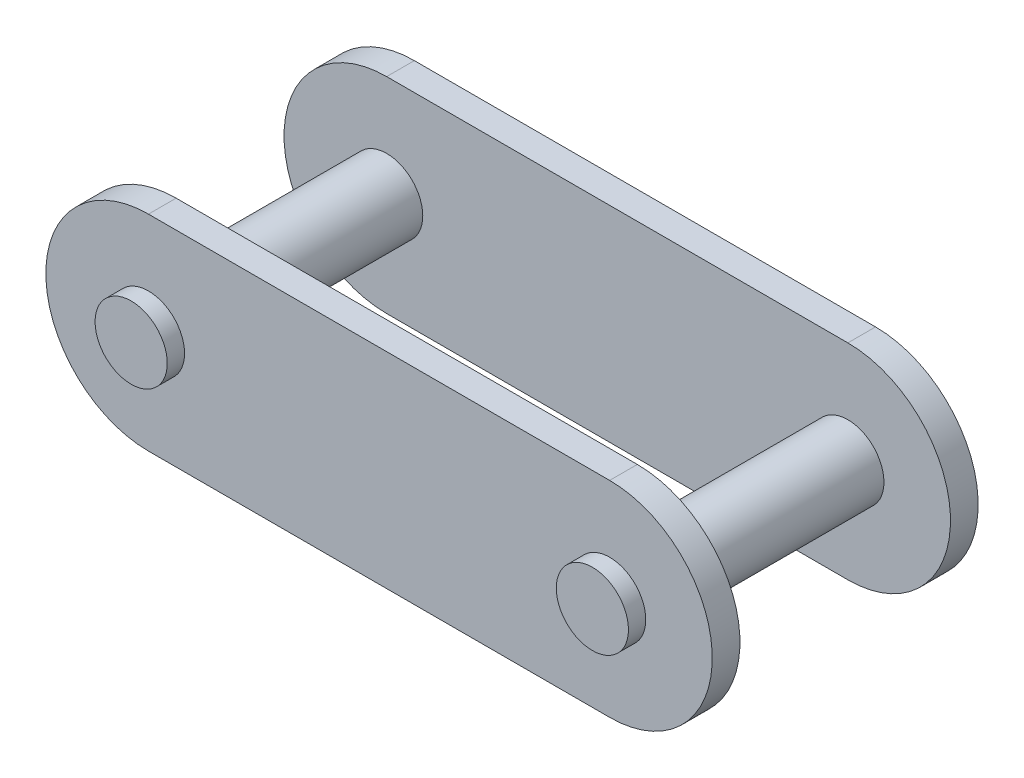
ISO-10303-21;
HEADER;
FILE_DESCRIPTION(('STEP AP214'),'2;1');
FILE_NAME('part.step','',(''),(''),'','','');
FILE_SCHEMA(('AUTOMOTIVE_DESIGN { 1 0 10303 214 1 1 1 1 }'));
ENDSEC;
DATA;
#1=APPLICATION_CONTEXT('core data for automotive mechanical design processes');
#2=APPLICATION_PROTOCOL_DEFINITION('international standard','automotive_design',2000,#1);
#3=PRODUCT_CONTEXT('',#1,'mechanical');
#4=PRODUCT('Part','Part','',(#3));
#5=PRODUCT_RELATED_PRODUCT_CATEGORY('part','',(#4));
#6=PRODUCT_DEFINITION_FORMATION('','',#4);
#7=PRODUCT_DEFINITION_CONTEXT('part definition',#1,'design');
#8=PRODUCT_DEFINITION('design','',#6,#7);
#9=PRODUCT_DEFINITION_SHAPE('','',#8);
#10=(LENGTH_UNIT() NAMED_UNIT(*) SI_UNIT(.MILLI.,.METRE.));
#11=(NAMED_UNIT(*) PLANE_ANGLE_UNIT() SI_UNIT($,.RADIAN.));
#12=(NAMED_UNIT(*) SI_UNIT($,.STERADIAN.) SOLID_ANGLE_UNIT());
#13=UNCERTAINTY_MEASURE_WITH_UNIT(LENGTH_MEASURE(1.E-05),#10,'distance_accuracy_value','');
#14=(GEOMETRIC_REPRESENTATION_CONTEXT(3) GLOBAL_UNCERTAINTY_ASSIGNED_CONTEXT((#13)) GLOBAL_UNIT_ASSIGNED_CONTEXT((#10,
#11,#12)) REPRESENTATION_CONTEXT('',''));
#15=CARTESIAN_POINT('',(0.,0.,0.));
#16=DIRECTION('',(0.,0.,1.));
#17=DIRECTION('',(1.,0.,0.));
#18=AXIS2_PLACEMENT_3D('',#15,#16,#17);
#19=CARTESIAN_POINT('',(-12.7,0.,1.524));
#20=DIRECTION('',(0.,0.,1.));
#21=DIRECTION('',(1.,0.,0.));
#22=AXIS2_PLACEMENT_3D('',#19,#20,#21);
#23=PLANE('',#22);
#24=CARTESIAN_POINT('',(-12.7,0.,1.524));
#25=DIRECTION('',(0.,0.,1.));
#26=DIRECTION('',(1.,0.,0.));
#27=AXIS2_PLACEMENT_3D('',#24,#25,#26);
#28=CIRCLE('',#27,1.98755);
#29=CARTESIAN_POINT('',(-10.71245,0.,1.524));
#30=VERTEX_POINT('',#29);
#31=EDGE_CURVE('E167',#30,#30,#28,.T.);
#32=ORIENTED_EDGE('',*,*,#31,.F.);
#33=EDGE_LOOP('',(#32));
#34=FACE_BOUND('',#33,.T.);
#35=CARTESIAN_POINT('',(-12.7,0.,1.524));
#36=DIRECTION('',(0.,0.,1.));
#37=DIRECTION('',(1.,0.,0.));
#38=AXIS2_PLACEMENT_3D('',#35,#36,#37);
#39=CIRCLE('',#38,5.6515);
#40=CARTESIAN_POINT('',(-12.7,5.6515,1.524));
#41=VERTEX_POINT('',#40);
#42=CARTESIAN_POINT('',(-12.7,-5.6515,1.524));
#43=VERTEX_POINT('',#42);
#44=EDGE_CURVE('E171',#41,#43,#39,.T.);
#45=ORIENTED_EDGE('',*,*,#44,.T.);
#46=DIRECTION('',(1.,0.,0.));
#47=VECTOR('',#46,1.);
#48=CARTESIAN_POINT('',(-12.7,-5.6515,1.524));
#49=LINE('',#48,#47);
#50=CARTESIAN_POINT('',(12.7,-5.6515,1.524));
#51=VERTEX_POINT('',#50);
#52=EDGE_CURVE('E79',#43,#51,#49,.T.);
#53=ORIENTED_EDGE('',*,*,#52,.T.);
#54=CARTESIAN_POINT('',(12.7,0.,1.524));
#55=DIRECTION('',(0.,0.,1.));
#56=DIRECTION('',(1.,0.,0.));
#57=AXIS2_PLACEMENT_3D('',#54,#55,#56);
#58=CIRCLE('',#57,5.6515);
#59=CARTESIAN_POINT('',(12.7,5.6515,1.524));
#60=VERTEX_POINT('',#59);
#61=EDGE_CURVE('E174',#51,#60,#58,.T.);
#62=ORIENTED_EDGE('',*,*,#61,.T.);
#63=DIRECTION('',(-1.,0.,0.));
#64=VECTOR('',#63,1.);
#65=CARTESIAN_POINT('',(-12.7,5.6515,1.524));
#66=LINE('',#65,#64);
#67=EDGE_CURVE('E48',#60,#41,#66,.T.);
#68=ORIENTED_EDGE('',*,*,#67,.T.);
#69=EDGE_LOOP('',(#45,#53,#62,#68));
#70=FACE_BOUND('',#69,.T.);
#71=CARTESIAN_POINT('',(12.7,0.,1.524));
#72=DIRECTION('',(0.,0.,1.));
#73=DIRECTION('',(1.,0.,0.));
#74=AXIS2_PLACEMENT_3D('',#71,#72,#73);
#75=CIRCLE('',#74,1.98755);
#76=CARTESIAN_POINT('',(14.68755,0.,1.524));
#77=VERTEX_POINT('',#76);
#78=EDGE_CURVE('E164',#77,#77,#75,.T.);
#79=ORIENTED_EDGE('',*,*,#78,.F.);
#80=EDGE_LOOP('',(#79));
#81=FACE_BOUND('',#80,.T.);
#82=ADVANCED_FACE('F31',(#34,#70,#81),#23,.T.);
#83=CARTESIAN_POINT('',(-12.7,0.,0.));
#84=DIRECTION('',(0.,0.,1.));
#85=DIRECTION('',(1.,0.,0.));
#86=AXIS2_PLACEMENT_3D('',#83,#84,#85);
#87=PLANE('',#86);
#88=CARTESIAN_POINT('',(-12.7,0.,0.));
#89=DIRECTION('',(0.,0.,1.));
#90=DIRECTION('',(1.,0.,0.));
#91=AXIS2_PLACEMENT_3D('',#88,#89,#90);
#92=CIRCLE('',#91,1.98755);
#93=CARTESIAN_POINT('',(-10.71245,0.,0.));
#94=VERTEX_POINT('',#93);
#95=EDGE_CURVE('E155',#94,#94,#92,.F.);
#96=ORIENTED_EDGE('',*,*,#95,.F.);
#97=EDGE_LOOP('',(#96));
#98=FACE_BOUND('',#97,.T.);
#99=CARTESIAN_POINT('',(-12.7,0.,0.));
#100=DIRECTION('',(0.,0.,1.));
#101=DIRECTION('',(1.,0.,0.));
#102=AXIS2_PLACEMENT_3D('',#99,#100,#101);
#103=CIRCLE('',#102,5.6515);
#104=CARTESIAN_POINT('',(-12.7,5.6515,0.));
#105=VERTEX_POINT('',#104);
#106=CARTESIAN_POINT('',(-12.7,-5.6515,0.));
#107=VERTEX_POINT('',#106);
#108=EDGE_CURVE('E170',#105,#107,#103,.T.);
#109=ORIENTED_EDGE('',*,*,#108,.F.);
#110=DIRECTION('',(-1.,0.,0.));
#111=VECTOR('',#110,1.);
#112=CARTESIAN_POINT('',(-12.7,5.6515,0.));
#113=LINE('',#112,#111);
#114=CARTESIAN_POINT('',(12.7,5.6515,0.));
#115=VERTEX_POINT('',#114);
#116=EDGE_CURVE('E72',#115,#105,#113,.T.);
#117=ORIENTED_EDGE('',*,*,#116,.F.);
#118=CARTESIAN_POINT('',(12.7,0.,0.));
#119=DIRECTION('',(0.,0.,1.));
#120=DIRECTION('',(1.,0.,0.));
#121=AXIS2_PLACEMENT_3D('',#118,#119,#120);
#122=CIRCLE('',#121,5.6515);
#123=CARTESIAN_POINT('',(12.7,-5.6515,0.));
#124=VERTEX_POINT('',#123);
#125=EDGE_CURVE('E66',#124,#115,#122,.T.);
#126=ORIENTED_EDGE('',*,*,#125,.F.);
#127=DIRECTION('',(1.,0.,0.));
#128=VECTOR('',#127,1.);
#129=CARTESIAN_POINT('',(-12.7,-5.6515,0.));
#130=LINE('',#129,#128);
#131=EDGE_CURVE('E180',#107,#124,#130,.T.);
#132=ORIENTED_EDGE('',*,*,#131,.F.);
#133=EDGE_LOOP('',(#109,#117,#126,#132));
#134=FACE_BOUND('',#133,.T.);
#135=CARTESIAN_POINT('',(12.7,0.,0.));
#136=DIRECTION('',(0.,0.,1.));
#137=DIRECTION('',(1.,0.,0.));
#138=AXIS2_PLACEMENT_3D('',#135,#136,#137);
#139=CIRCLE('',#138,1.98755);
#140=CARTESIAN_POINT('',(14.68755,0.,0.));
#141=VERTEX_POINT('',#140);
#142=EDGE_CURVE('E161',#141,#141,#139,.F.);
#143=ORIENTED_EDGE('',*,*,#142,.F.);
#144=EDGE_LOOP('',(#143));
#145=FACE_BOUND('',#144,.T.);
#146=ADVANCED_FACE('F190',(#98,#134,#145),#87,.F.);
#147=CARTESIAN_POINT('',(-12.7,0.,1.524));
#148=DIRECTION('',(0.,0.,-1.));
#149=DIRECTION('',(-1.,0.,0.));
#150=AXIS2_PLACEMENT_3D('',#147,#148,#149);
#151=CYLINDRICAL_SURFACE('',#150,5.6515);
#152=ORIENTED_EDGE('',*,*,#108,.T.);
#153=DIRECTION('',(0.,0.,-1.));
#154=VECTOR('',#153,1.);
#155=CARTESIAN_POINT('',(-12.7,-5.6515,1.524));
#156=LINE('',#155,#154);
#157=EDGE_CURVE('E11',#43,#107,#156,.T.);
#158=ORIENTED_EDGE('',*,*,#157,.F.);
#159=ORIENTED_EDGE('',*,*,#44,.F.);
#160=DIRECTION('',(0.,0.,-1.));
#161=VECTOR('',#160,1.);
#162=CARTESIAN_POINT('',(-12.7,5.6515,1.524));
#163=LINE('',#162,#161);
#164=EDGE_CURVE('E177',#41,#105,#163,.T.);
#165=ORIENTED_EDGE('',*,*,#164,.T.);
#166=EDGE_LOOP('',(#152,#158,#159,#165));
#167=FACE_BOUND('',#166,.T.);
#168=ADVANCED_FACE('F33',(#167),#151,.T.);
#169=CARTESIAN_POINT('',(-12.7,-5.6515,1.524));
#170=DIRECTION('',(0.,1.,0.));
#171=DIRECTION('',(-1.,0.,0.));
#172=AXIS2_PLACEMENT_3D('',#169,#170,#171);
#173=PLANE('',#172);
#174=ORIENTED_EDGE('',*,*,#131,.T.);
#175=DIRECTION('',(0.,0.,-1.));
#176=VECTOR('',#175,1.);
#177=CARTESIAN_POINT('',(12.7,-5.6515,1.524));
#178=LINE('',#177,#176);
#179=EDGE_CURVE('E40',#51,#124,#178,.T.);
#180=ORIENTED_EDGE('',*,*,#179,.F.);
#181=ORIENTED_EDGE('',*,*,#52,.F.);
#182=ORIENTED_EDGE('',*,*,#157,.T.);
#183=EDGE_LOOP('',(#174,#180,#181,#182));
#184=FACE_BOUND('',#183,.T.);
#185=ADVANCED_FACE('F207',(#184),#173,.F.);
#186=CARTESIAN_POINT('',(12.7,0.,1.524));
#187=DIRECTION('',(0.,0.,-1.));
#188=DIRECTION('',(-1.,0.,0.));
#189=AXIS2_PLACEMENT_3D('',#186,#187,#188);
#190=CYLINDRICAL_SURFACE('',#189,5.6515);
#191=ORIENTED_EDGE('',*,*,#125,.T.);
#192=DIRECTION('',(0.,0.,-1.));
#193=VECTOR('',#192,1.);
#194=CARTESIAN_POINT('',(12.7,5.6515,1.524));
#195=LINE('',#194,#193);
#196=EDGE_CURVE('E185',#60,#115,#195,.T.);
#197=ORIENTED_EDGE('',*,*,#196,.F.);
#198=ORIENTED_EDGE('',*,*,#61,.F.);
#199=ORIENTED_EDGE('',*,*,#179,.T.);
#200=EDGE_LOOP('',(#191,#197,#198,#199));
#201=FACE_BOUND('',#200,.T.);
#202=ADVANCED_FACE('F187',(#201),#190,.T.);
#203=CARTESIAN_POINT('',(-12.7,5.6515,1.524));
#204=DIRECTION('',(0.,-1.,0.));
#205=DIRECTION('',(1.,0.,0.));
#206=AXIS2_PLACEMENT_3D('',#203,#204,#205);
#207=PLANE('',#206);
#208=ORIENTED_EDGE('',*,*,#116,.T.);
#209=ORIENTED_EDGE('',*,*,#164,.F.);
#210=ORIENTED_EDGE('',*,*,#67,.F.);
#211=ORIENTED_EDGE('',*,*,#196,.T.);
#212=EDGE_LOOP('',(#208,#209,#210,#211));
#213=FACE_BOUND('',#212,.T.);
#214=ADVANCED_FACE('F195',(#213),#207,.F.);
#215=CARTESIAN_POINT('',(12.7,0.,-11.4191903317893));
#216=DIRECTION('',(0.,0.,1.));
#217=DIRECTION('',(1.,0.,0.));
#218=AXIS2_PLACEMENT_3D('',#215,#216,#217);
#219=CYLINDRICAL_SURFACE('',#218,1.98755);
#220=ORIENTED_EDGE('',*,*,#142,.T.);
#221=EDGE_LOOP('',(#220));
#222=FACE_BOUND('',#221,.T.);
#223=CARTESIAN_POINT('',(12.7,0.,-11.5951));
#224=DIRECTION('',(0.,0.,1.));
#225=DIRECTION('',(1.,0.,0.));
#226=AXIS2_PLACEMENT_3D('',#223,#224,#225);
#227=CIRCLE('',#226,1.98755);
#228=CARTESIAN_POINT('',(14.68755,0.,-11.5951));
#229=VERTEX_POINT('',#228);
#230=EDGE_CURVE('E281',#229,#229,#227,.F.);
#231=ORIENTED_EDGE('',*,*,#230,.F.);
#232=EDGE_LOOP('',(#231));
#233=FACE_BOUND('',#232,.T.);
#234=ADVANCED_FACE('F197',(#222,#233),#219,.T.);
#235=CARTESIAN_POINT('',(12.7,0.,2.4765));
#236=DIRECTION('',(0.,0.,-1.));
#237=DIRECTION('',(-1.,0.,0.));
#238=AXIS2_PLACEMENT_3D('',#235,#236,#237);
#239=PLANE('',#238);
#240=CARTESIAN_POINT('',(12.7,0.,2.4765));
#241=DIRECTION('',(0.,0.,-1.));
#242=DIRECTION('',(-1.,0.,0.));
#243=AXIS2_PLACEMENT_3D('',#240,#241,#242);
#244=CIRCLE('',#243,1.98755);
#245=CARTESIAN_POINT('',(10.71245,0.,2.4765));
#246=VERTEX_POINT('',#245);
#247=EDGE_CURVE('E158',#246,#246,#244,.T.);
#248=ORIENTED_EDGE('',*,*,#247,.F.);
#249=EDGE_LOOP('',(#248));
#250=FACE_BOUND('',#249,.T.);
#251=ADVANCED_FACE('F203',(#250),#239,.F.);
#252=ORIENTED_EDGE('',*,*,#78,.T.);
#253=EDGE_LOOP('',(#252));
#254=FACE_BOUND('',#253,.T.);
#255=ORIENTED_EDGE('',*,*,#247,.T.);
#256=EDGE_LOOP('',(#255));
#257=FACE_BOUND('',#256,.T.);
#258=ADVANCED_FACE('F206',(#254,#257),#219,.T.);
#259=CARTESIAN_POINT('',(-12.7,0.,-11.4191903317893));
#260=DIRECTION('',(0.,0.,1.));
#261=DIRECTION('',(1.,0.,0.));
#262=AXIS2_PLACEMENT_3D('',#259,#260,#261);
#263=CYLINDRICAL_SURFACE('',#262,1.98755);
#264=ORIENTED_EDGE('',*,*,#95,.T.);
#265=EDGE_LOOP('',(#264));
#266=FACE_BOUND('',#265,.T.);
#267=CARTESIAN_POINT('',(-12.7,0.,-11.5951));
#268=DIRECTION('',(0.,0.,1.));
#269=DIRECTION('',(1.,0.,0.));
#270=AXIS2_PLACEMENT_3D('',#267,#268,#269);
#271=CIRCLE('',#270,1.98755);
#272=CARTESIAN_POINT('',(-10.71245,0.,-11.5951));
#273=VERTEX_POINT('',#272);
#274=EDGE_CURVE('E273',#273,#273,#271,.F.);
#275=ORIENTED_EDGE('',*,*,#274,.F.);
#276=EDGE_LOOP('',(#275));
#277=FACE_BOUND('',#276,.T.);
#278=ADVANCED_FACE('F220',(#266,#277),#263,.T.);
#279=CARTESIAN_POINT('',(-12.7,0.,2.4765));
#280=DIRECTION('',(0.,0.,-1.));
#281=DIRECTION('',(-1.,0.,0.));
#282=AXIS2_PLACEMENT_3D('',#279,#280,#281);
#283=PLANE('',#282);
#284=CARTESIAN_POINT('',(-12.7,0.,2.4765));
#285=DIRECTION('',(0.,0.,-1.));
#286=DIRECTION('',(-1.,0.,0.));
#287=AXIS2_PLACEMENT_3D('',#284,#285,#286);
#288=CIRCLE('',#287,1.98755);
#289=CARTESIAN_POINT('',(-14.68755,0.,2.4765));
#290=VERTEX_POINT('',#289);
#291=EDGE_CURVE('E117',#290,#290,#288,.T.);
#292=ORIENTED_EDGE('',*,*,#291,.F.);
#293=EDGE_LOOP('',(#292));
#294=FACE_BOUND('',#293,.T.);
#295=ADVANCED_FACE('F228',(#294),#283,.F.);
#296=ORIENTED_EDGE('',*,*,#31,.T.);
#297=EDGE_LOOP('',(#296));
#298=FACE_BOUND('',#297,.T.);
#299=ORIENTED_EDGE('',*,*,#291,.T.);
#300=EDGE_LOOP('',(#299));
#301=FACE_BOUND('',#300,.T.);
#302=ADVANCED_FACE('F225',(#298,#301),#263,.T.);
#303=CARTESIAN_POINT('',(-12.7,0.,-13.1191));
#304=DIRECTION('',(0.,0.,-1.));
#305=DIRECTION('',(1.,0.,0.));
#306=AXIS2_PLACEMENT_3D('',#303,#304,#305);
#307=PLANE('',#306);
#308=CARTESIAN_POINT('',(-12.7,0.,-13.1191));
#309=DIRECTION('',(0.,0.,1.));
#310=DIRECTION('',(1.,0.,0.));
#311=AXIS2_PLACEMENT_3D('',#308,#309,#310);
#312=CIRCLE('',#311,1.98755);
#313=CARTESIAN_POINT('',(-10.71245,0.,-13.1191));
#314=VERTEX_POINT('',#313);
#315=EDGE_CURVE('E138',#314,#314,#312,.T.);
#316=ORIENTED_EDGE('',*,*,#315,.T.);
#317=EDGE_LOOP('',(#316));
#318=FACE_BOUND('',#317,.T.);
#319=CARTESIAN_POINT('',(-12.7,0.,-13.1191));
#320=DIRECTION('',(0.,0.,1.));
#321=DIRECTION('',(1.,0.,0.));
#322=AXIS2_PLACEMENT_3D('',#319,#320,#321);
#323=CIRCLE('',#322,5.6515);
#324=CARTESIAN_POINT('',(-12.7,5.6515,-13.1191));
#325=VERTEX_POINT('',#324);
#326=CARTESIAN_POINT('',(-12.7,-5.6515,-13.1191));
#327=VERTEX_POINT('',#326);
#328=EDGE_CURVE('E125',#325,#327,#323,.T.);
#329=ORIENTED_EDGE('',*,*,#328,.F.);
#330=DIRECTION('',(-1.,0.,0.));
#331=VECTOR('',#330,1.);
#332=CARTESIAN_POINT('',(-12.7,5.6515,-13.1191));
#333=LINE('',#332,#331);
#334=CARTESIAN_POINT('',(12.7,5.6515,-13.1191));
#335=VERTEX_POINT('',#334);
#336=EDGE_CURVE('E142',#335,#325,#333,.T.);
#337=ORIENTED_EDGE('',*,*,#336,.F.);
#338=CARTESIAN_POINT('',(12.7,0.,-13.1191));
#339=DIRECTION('',(0.,0.,1.));
#340=DIRECTION('',(1.,0.,0.));
#341=AXIS2_PLACEMENT_3D('',#338,#339,#340);
#342=CIRCLE('',#341,5.6515);
#343=CARTESIAN_POINT('',(12.7,-5.6515,-13.1191));
#344=VERTEX_POINT('',#343);
#345=EDGE_CURVE('E127',#344,#335,#342,.T.);
#346=ORIENTED_EDGE('',*,*,#345,.F.);
#347=DIRECTION('',(1.,0.,0.));
#348=VECTOR('',#347,1.);
#349=CARTESIAN_POINT('',(-12.7,-5.6515,-13.1191));
#350=LINE('',#349,#348);
#351=EDGE_CURVE('E109',#327,#344,#350,.T.);
#352=ORIENTED_EDGE('',*,*,#351,.F.);
#353=EDGE_LOOP('',(#329,#337,#346,#352));
#354=FACE_BOUND('',#353,.T.);
#355=CARTESIAN_POINT('',(12.7,0.,-13.1191));
#356=DIRECTION('',(0.,0.,1.));
#357=DIRECTION('',(1.,0.,0.));
#358=AXIS2_PLACEMENT_3D('',#355,#356,#357);
#359=CIRCLE('',#358,1.98755);
#360=CARTESIAN_POINT('',(14.68755,0.,-13.1191));
#361=VERTEX_POINT('',#360);
#362=EDGE_CURVE('E283',#361,#361,#359,.T.);
#363=ORIENTED_EDGE('',*,*,#362,.T.);
#364=EDGE_LOOP('',(#363));
#365=FACE_BOUND('',#364,.T.);
#366=ADVANCED_FACE('F122',(#318,#354,#365),#307,.T.);
#367=CARTESIAN_POINT('',(-12.7,0.,-11.5951));
#368=DIRECTION('',(0.,0.,-1.));
#369=DIRECTION('',(1.,0.,0.));
#370=AXIS2_PLACEMENT_3D('',#367,#368,#369);
#371=PLANE('',#370);
#372=ORIENTED_EDGE('',*,*,#274,.T.);
#373=EDGE_LOOP('',(#372));
#374=FACE_BOUND('',#373,.T.);
#375=CARTESIAN_POINT('',(-12.7,0.,-11.5951));
#376=DIRECTION('',(0.,0.,1.));
#377=DIRECTION('',(1.,0.,0.));
#378=AXIS2_PLACEMENT_3D('',#375,#376,#377);
#379=CIRCLE('',#378,5.6515);
#380=CARTESIAN_POINT('',(-12.7,5.6515,-11.5951));
#381=VERTEX_POINT('',#380);
#382=CARTESIAN_POINT('',(-12.7,-5.6515,-11.5951));
#383=VERTEX_POINT('',#382);
#384=EDGE_CURVE('E144',#381,#383,#379,.T.);
#385=ORIENTED_EDGE('',*,*,#384,.T.);
#386=DIRECTION('',(1.,0.,0.));
#387=VECTOR('',#386,1.);
#388=CARTESIAN_POINT('',(-12.7,-5.6515,-11.5951));
#389=LINE('',#388,#387);
#390=CARTESIAN_POINT('',(12.7,-5.6515,-11.5951));
#391=VERTEX_POINT('',#390);
#392=EDGE_CURVE('E112',#383,#391,#389,.T.);
#393=ORIENTED_EDGE('',*,*,#392,.T.);
#394=CARTESIAN_POINT('',(12.7,0.,-11.5951));
#395=DIRECTION('',(0.,0.,1.));
#396=DIRECTION('',(1.,0.,0.));
#397=AXIS2_PLACEMENT_3D('',#394,#395,#396);
#398=CIRCLE('',#397,5.6515);
#399=CARTESIAN_POINT('',(12.7,5.6515,-11.5951));
#400=VERTEX_POINT('',#399);
#401=EDGE_CURVE('E135',#391,#400,#398,.T.);
#402=ORIENTED_EDGE('',*,*,#401,.T.);
#403=DIRECTION('',(-1.,0.,0.));
#404=VECTOR('',#403,1.);
#405=CARTESIAN_POINT('',(-12.7,5.6515,-11.5951));
#406=LINE('',#405,#404);
#407=EDGE_CURVE('E132',#400,#381,#406,.T.);
#408=ORIENTED_EDGE('',*,*,#407,.T.);
#409=EDGE_LOOP('',(#385,#393,#402,#408));
#410=FACE_BOUND('',#409,.T.);
#411=ORIENTED_EDGE('',*,*,#230,.T.);
#412=EDGE_LOOP('',(#411));
#413=FACE_BOUND('',#412,.T.);
#414=ADVANCED_FACE('F235',(#374,#410,#413),#371,.F.);
#415=CARTESIAN_POINT('',(-12.7,0.,-13.1191));
#416=DIRECTION('',(0.,0.,1.));
#417=DIRECTION('',(-1.,0.,0.));
#418=AXIS2_PLACEMENT_3D('',#415,#416,#417);
#419=CYLINDRICAL_SURFACE('',#418,5.6515);
#420=ORIENTED_EDGE('',*,*,#384,.F.);
#421=DIRECTION('',(0.,0.,1.));
#422=VECTOR('',#421,1.);
#423=CARTESIAN_POINT('',(-12.7,5.6515,-13.1191));
#424=LINE('',#423,#422);
#425=EDGE_CURVE('E130',#325,#381,#424,.T.);
#426=ORIENTED_EDGE('',*,*,#425,.F.);
#427=ORIENTED_EDGE('',*,*,#328,.T.);
#428=DIRECTION('',(0.,0.,1.));
#429=VECTOR('',#428,1.);
#430=CARTESIAN_POINT('',(-12.7,-5.6515,-13.1191));
#431=LINE('',#430,#429);
#432=EDGE_CURVE('E106',#327,#383,#431,.T.);
#433=ORIENTED_EDGE('',*,*,#432,.T.);
#434=EDGE_LOOP('',(#420,#426,#427,#433));
#435=FACE_BOUND('',#434,.T.);
#436=ADVANCED_FACE('F129',(#435),#419,.T.);
#437=CARTESIAN_POINT('',(-12.7,-5.6515,-13.1191));
#438=DIRECTION('',(0.,1.,0.));
#439=DIRECTION('',(-1.,0.,0.));
#440=AXIS2_PLACEMENT_3D('',#437,#438,#439);
#441=PLANE('',#440);
#442=ORIENTED_EDGE('',*,*,#392,.F.);
#443=ORIENTED_EDGE('',*,*,#432,.F.);
#444=ORIENTED_EDGE('',*,*,#351,.T.);
#445=DIRECTION('',(0.,0.,1.));
#446=VECTOR('',#445,1.);
#447=CARTESIAN_POINT('',(12.7,-5.6515,-13.1191));
#448=LINE('',#447,#446);
#449=EDGE_CURVE('E118',#344,#391,#448,.T.);
#450=ORIENTED_EDGE('',*,*,#449,.T.);
#451=EDGE_LOOP('',(#442,#443,#444,#450));
#452=FACE_BOUND('',#451,.T.);
#453=ADVANCED_FACE('F108',(#452),#441,.F.);
#454=CARTESIAN_POINT('',(12.7,0.,-13.1191));
#455=DIRECTION('',(0.,0.,1.));
#456=DIRECTION('',(-1.,0.,0.));
#457=AXIS2_PLACEMENT_3D('',#454,#455,#456);
#458=CYLINDRICAL_SURFACE('',#457,5.6515);
#459=ORIENTED_EDGE('',*,*,#401,.F.);
#460=ORIENTED_EDGE('',*,*,#449,.F.);
#461=ORIENTED_EDGE('',*,*,#345,.T.);
#462=DIRECTION('',(0.,0.,1.));
#463=VECTOR('',#462,1.);
#464=CARTESIAN_POINT('',(12.7,5.6515,-13.1191));
#465=LINE('',#464,#463);
#466=EDGE_CURVE('E150',#335,#400,#465,.T.);
#467=ORIENTED_EDGE('',*,*,#466,.T.);
#468=EDGE_LOOP('',(#459,#460,#461,#467));
#469=FACE_BOUND('',#468,.T.);
#470=ADVANCED_FACE('F238',(#469),#458,.T.);
#471=CARTESIAN_POINT('',(-12.7,5.6515,-13.1191));
#472=DIRECTION('',(0.,-1.,0.));
#473=DIRECTION('',(1.,0.,0.));
#474=AXIS2_PLACEMENT_3D('',#471,#472,#473);
#475=PLANE('',#474);
#476=ORIENTED_EDGE('',*,*,#407,.F.);
#477=ORIENTED_EDGE('',*,*,#466,.F.);
#478=ORIENTED_EDGE('',*,*,#336,.T.);
#479=ORIENTED_EDGE('',*,*,#425,.T.);
#480=EDGE_LOOP('',(#476,#477,#478,#479));
#481=FACE_BOUND('',#480,.T.);
#482=ADVANCED_FACE('F241',(#481),#475,.F.);
#483=CARTESIAN_POINT('',(12.7,0.,-14.0716));
#484=DIRECTION('',(0.,0.,1.));
#485=DIRECTION('',(-1.,0.,0.));
#486=AXIS2_PLACEMENT_3D('',#483,#484,#485);
#487=PLANE('',#486);
#488=CARTESIAN_POINT('',(12.7,0.,-14.0716));
#489=DIRECTION('',(0.,0.,-1.));
#490=DIRECTION('',(-1.,0.,0.));
#491=AXIS2_PLACEMENT_3D('',#488,#489,#490);
#492=CIRCLE('',#491,1.98755);
#493=CARTESIAN_POINT('',(10.71245,0.,-14.0716));
#494=VERTEX_POINT('',#493);
#495=EDGE_CURVE('E276',#494,#494,#492,.T.);
#496=ORIENTED_EDGE('',*,*,#495,.T.);
#497=EDGE_LOOP('',(#496));
#498=FACE_BOUND('',#497,.T.);
#499=ADVANCED_FACE('F245',(#498),#487,.F.);
#500=CARTESIAN_POINT('',(12.7,0.,-0.175909668210711));
#501=DIRECTION('',(0.,0.,-1.));
#502=DIRECTION('',(1.,0.,0.));
#503=AXIS2_PLACEMENT_3D('',#500,#501,#502);
#504=CYLINDRICAL_SURFACE('',#503,1.98755);
#505=ORIENTED_EDGE('',*,*,#362,.F.);
#506=EDGE_LOOP('',(#505));
#507=FACE_BOUND('',#506,.T.);
#508=ORIENTED_EDGE('',*,*,#495,.F.);
#509=EDGE_LOOP('',(#508));
#510=FACE_BOUND('',#509,.T.);
#511=ADVANCED_FACE('F253',(#507,#510),#504,.T.);
#512=CARTESIAN_POINT('',(-12.7,0.,-14.0716));
#513=DIRECTION('',(0.,0.,1.));
#514=DIRECTION('',(-1.,0.,0.));
#515=AXIS2_PLACEMENT_3D('',#512,#513,#514);
#516=PLANE('',#515);
#517=CARTESIAN_POINT('',(-12.7,0.,-14.0716));
#518=DIRECTION('',(0.,0.,-1.));
#519=DIRECTION('',(-1.,0.,0.));
#520=AXIS2_PLACEMENT_3D('',#517,#518,#519);
#521=CIRCLE('',#520,1.98755);
#522=CARTESIAN_POINT('',(-14.68755,0.,-14.0716));
#523=VERTEX_POINT('',#522);
#524=EDGE_CURVE('E271',#523,#523,#521,.T.);
#525=ORIENTED_EDGE('',*,*,#524,.T.);
#526=EDGE_LOOP('',(#525));
#527=FACE_BOUND('',#526,.T.);
#528=ADVANCED_FACE('F256',(#527),#516,.F.);
#529=CARTESIAN_POINT('',(-12.7,0.,-0.175909668210711));
#530=DIRECTION('',(0.,0.,-1.));
#531=DIRECTION('',(1.,0.,0.));
#532=AXIS2_PLACEMENT_3D('',#529,#530,#531);
#533=CYLINDRICAL_SURFACE('',#532,1.98755);
#534=ORIENTED_EDGE('',*,*,#315,.F.);
#535=EDGE_LOOP('',(#534));
#536=FACE_BOUND('',#535,.T.);
#537=ORIENTED_EDGE('',*,*,#524,.F.);
#538=EDGE_LOOP('',(#537));
#539=FACE_BOUND('',#538,.T.);
#540=ADVANCED_FACE('F261',(#536,#539),#533,.T.);
#541=CLOSED_SHELL('',(#82,#146,#168,#185,#202,#214,#234,#251,#258,#278,#295,#302,#366,#414,#436,
#453,#470,#482,#499,#511,#528,#540));
#542=MANIFOLD_SOLID_BREP('B2',#541);
#543=ADVANCED_BREP_SHAPE_REPRESENTATION('',(#18,#542),#14);
#544=SHAPE_DEFINITION_REPRESENTATION(#9,#543);
ENDSEC;
END-ISO-10303-21;
